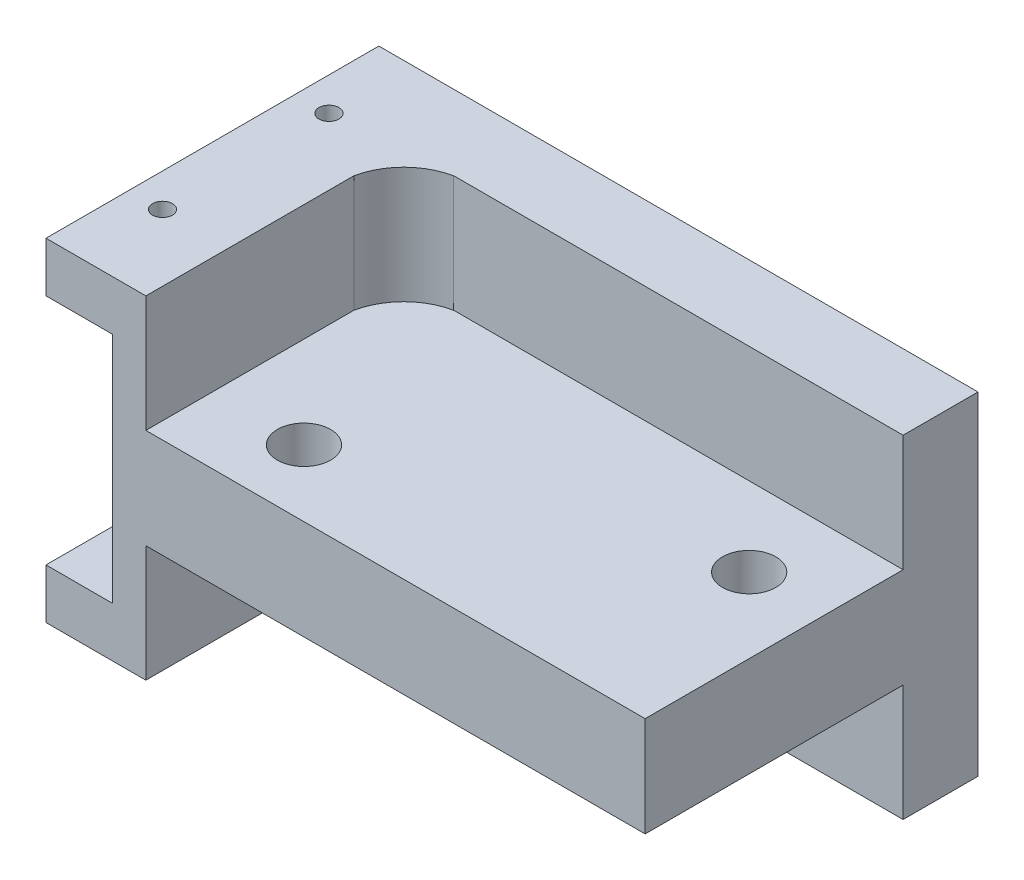
ISO-10303-21;
HEADER;
FILE_DESCRIPTION(('STEP AP214'),'2;1');
FILE_NAME('part.step','',(''),(''),'','','');
FILE_SCHEMA(('AUTOMOTIVE_DESIGN { 1 0 10303 214 1 1 1 1 }'));
ENDSEC;
DATA;
#1=APPLICATION_CONTEXT('core data for automotive mechanical design processes');
#2=APPLICATION_PROTOCOL_DEFINITION('international standard','automotive_design',2000,#1);
#3=PRODUCT_CONTEXT('',#1,'mechanical');
#4=PRODUCT('Part','Part','',(#3));
#5=PRODUCT_RELATED_PRODUCT_CATEGORY('part','',(#4));
#6=PRODUCT_DEFINITION_FORMATION('','',#4);
#7=PRODUCT_DEFINITION_CONTEXT('part definition',#1,'design');
#8=PRODUCT_DEFINITION('design','',#6,#7);
#9=PRODUCT_DEFINITION_SHAPE('','',#8);
#10=(LENGTH_UNIT() NAMED_UNIT(*) SI_UNIT(.MILLI.,.METRE.));
#11=(NAMED_UNIT(*) PLANE_ANGLE_UNIT() SI_UNIT($,.RADIAN.));
#12=(NAMED_UNIT(*) SI_UNIT($,.STERADIAN.) SOLID_ANGLE_UNIT());
#13=UNCERTAINTY_MEASURE_WITH_UNIT(LENGTH_MEASURE(1.E-05),#10,'distance_accuracy_value','');
#14=(GEOMETRIC_REPRESENTATION_CONTEXT(3) GLOBAL_UNCERTAINTY_ASSIGNED_CONTEXT((#13)) GLOBAL_UNIT_ASSIGNED_CONTEXT((#10,
#11,#12)) REPRESENTATION_CONTEXT('',''));
#15=CARTESIAN_POINT('',(0.,0.,0.));
#16=DIRECTION('',(0.,0.,1.));
#17=DIRECTION('',(1.,0.,0.));
#18=AXIS2_PLACEMENT_3D('',#15,#16,#17);
#19=CARTESIAN_POINT('',(17.5,10.,10.));
#20=DIRECTION('',(-1.,0.,0.));
#21=DIRECTION('',(0.,0.,1.));
#22=AXIS2_PLACEMENT_3D('',#19,#20,#21);
#23=PLANE('',#22);
#24=DIRECTION('',(0.,0.,1.));
#25=VECTOR('',#24,1.);
#26=CARTESIAN_POINT('',(17.5,-3.,10.));
#27=LINE('',#26,#25);
#28=CARTESIAN_POINT('',(17.5,-3.,-5.5));
#29=VERTEX_POINT('',#28);
#30=CARTESIAN_POINT('',(17.5,-3.,10.));
#31=VERTEX_POINT('',#30);
#32=EDGE_CURVE('E255',#29,#31,#27,.T.);
#33=ORIENTED_EDGE('',*,*,#32,.F.);
#34=DIRECTION('',(0.,-1.,0.));
#35=VECTOR('',#34,1.);
#36=CARTESIAN_POINT('',(17.5,-3.,-5.5));
#37=LINE('',#36,#35);
#38=CARTESIAN_POINT('',(17.5,-10.,-5.5));
#39=VERTEX_POINT('',#38);
#40=EDGE_CURVE('E263',#29,#39,#37,.T.);
#41=ORIENTED_EDGE('',*,*,#40,.T.);
#42=DIRECTION('',(0.,0.,-1.));
#43=VECTOR('',#42,1.);
#44=CARTESIAN_POINT('',(17.5,-10.,10.));
#45=LINE('',#44,#43);
#46=CARTESIAN_POINT('',(17.5,-10.,-10.));
#47=VERTEX_POINT('',#46);
#48=EDGE_CURVE('E163',#39,#47,#45,.T.);
#49=ORIENTED_EDGE('',*,*,#48,.T.);
#50=DIRECTION('',(0.,-1.,0.));
#51=VECTOR('',#50,1.);
#52=CARTESIAN_POINT('',(17.5,10.,-10.));
#53=LINE('',#52,#51);
#54=CARTESIAN_POINT('',(17.5,10.,-10.));
#55=VERTEX_POINT('',#54);
#56=EDGE_CURVE('E11',#55,#47,#53,.T.);
#57=ORIENTED_EDGE('',*,*,#56,.F.);
#58=DIRECTION('',(0.,0.,-1.));
#59=VECTOR('',#58,1.);
#60=CARTESIAN_POINT('',(17.5,10.,10.));
#61=LINE('',#60,#59);
#62=CARTESIAN_POINT('',(17.5,10.,-5.5));
#63=VERTEX_POINT('',#62);
#64=EDGE_CURVE('E302',#63,#55,#61,.T.);
#65=ORIENTED_EDGE('',*,*,#64,.F.);
#66=DIRECTION('',(0.,1.,0.));
#67=VECTOR('',#66,1.);
#68=CARTESIAN_POINT('',(17.5,3.,-5.5));
#69=LINE('',#68,#67);
#70=CARTESIAN_POINT('',(17.5,3.,-5.5));
#71=VERTEX_POINT('',#70);
#72=EDGE_CURVE('E287',#71,#63,#69,.T.);
#73=ORIENTED_EDGE('',*,*,#72,.F.);
#74=DIRECTION('',(0.,0.,-1.));
#75=VECTOR('',#74,1.);
#76=CARTESIAN_POINT('',(17.5,3.,-5.5));
#77=LINE('',#76,#75);
#78=CARTESIAN_POINT('',(17.5,3.,10.));
#79=VERTEX_POINT('',#78);
#80=EDGE_CURVE('E274',#79,#71,#77,.T.);
#81=ORIENTED_EDGE('',*,*,#80,.F.);
#82=DIRECTION('',(0.,-1.,0.));
#83=VECTOR('',#82,1.);
#84=CARTESIAN_POINT('',(17.5,10.,10.));
#85=LINE('',#84,#83);
#86=EDGE_CURVE('E44',#79,#31,#85,.T.);
#87=ORIENTED_EDGE('',*,*,#86,.T.);
#88=EDGE_LOOP('',(#33,#41,#49,#57,#65,#73,#81,#87));
#89=FACE_BOUND('',#88,.T.);
#90=ADVANCED_FACE('F36',(#89),#23,.F.);
#91=CARTESIAN_POINT('',(-17.5,10.,-10.));
#92=DIRECTION('',(0.,0.,1.));
#93=DIRECTION('',(1.,0.,0.));
#94=AXIS2_PLACEMENT_3D('',#91,#92,#93);
#95=PLANE('',#94);
#96=DIRECTION('',(0.,-1.,0.));
#97=VECTOR('',#96,1.);
#98=CARTESIAN_POINT('',(-14.5,7.,-10.));
#99=LINE('',#98,#97);
#100=CARTESIAN_POINT('',(-14.5,7.,-10.));
#101=VERTEX_POINT('',#100);
#102=CARTESIAN_POINT('',(-14.5,-7.,-10.));
#103=VERTEX_POINT('',#102);
#104=EDGE_CURVE('E211',#101,#103,#99,.T.);
#105=ORIENTED_EDGE('',*,*,#104,.F.);
#106=DIRECTION('',(-1.,0.,0.));
#107=VECTOR('',#106,1.);
#108=CARTESIAN_POINT('',(-14.5,7.,-10.));
#109=LINE('',#108,#107);
#110=CARTESIAN_POINT('',(-18.5,7.,-10.));
#111=VERTEX_POINT('',#110);
#112=EDGE_CURVE('E228',#101,#111,#109,.T.);
#113=ORIENTED_EDGE('',*,*,#112,.T.);
#114=DIRECTION('',(0.,-1.,0.));
#115=VECTOR('',#114,1.);
#116=CARTESIAN_POINT('',(-18.5,10.,-10.));
#117=LINE('',#116,#115);
#118=CARTESIAN_POINT('',(-18.5,10.,-10.));
#119=VERTEX_POINT('',#118);
#120=EDGE_CURVE('E183',#119,#111,#117,.T.);
#121=ORIENTED_EDGE('',*,*,#120,.F.);
#122=DIRECTION('',(-1.,0.,0.));
#123=VECTOR('',#122,1.);
#124=CARTESIAN_POINT('',(-17.5,10.,-10.));
#125=LINE('',#124,#123);
#126=EDGE_CURVE('E304',#55,#119,#125,.T.);
#127=ORIENTED_EDGE('',*,*,#126,.F.);
#128=ORIENTED_EDGE('',*,*,#56,.T.);
#129=DIRECTION('',(-1.,0.,0.));
#130=VECTOR('',#129,1.);
#131=CARTESIAN_POINT('',(-17.5,-10.,-10.));
#132=LINE('',#131,#130);
#133=CARTESIAN_POINT('',(-18.5,-10.,-10.));
#134=VERTEX_POINT('',#133);
#135=EDGE_CURVE('E151',#47,#134,#132,.T.);
#136=ORIENTED_EDGE('',*,*,#135,.T.);
#137=DIRECTION('',(0.,-1.,0.));
#138=VECTOR('',#137,1.);
#139=CARTESIAN_POINT('',(-18.5,-7.,-10.));
#140=LINE('',#139,#138);
#141=CARTESIAN_POINT('',(-18.5,-7.,-10.));
#142=VERTEX_POINT('',#141);
#143=EDGE_CURVE('E157',#142,#134,#140,.T.);
#144=ORIENTED_EDGE('',*,*,#143,.F.);
#145=DIRECTION('',(-1.,0.,0.));
#146=VECTOR('',#145,1.);
#147=CARTESIAN_POINT('',(-14.5,-7.,-10.));
#148=LINE('',#147,#146);
#149=EDGE_CURVE('E227',#103,#142,#148,.T.);
#150=ORIENTED_EDGE('',*,*,#149,.F.);
#151=EDGE_LOOP('',(#105,#113,#121,#127,#128,#136,#144,#150));
#152=FACE_BOUND('',#151,.T.);
#153=ADVANCED_FACE('F154',(#152),#95,.F.);
#154=CARTESIAN_POINT('',(-17.5,10.,10.));
#155=DIRECTION('',(0.,0.,-1.));
#156=DIRECTION('',(-1.,0.,0.));
#157=AXIS2_PLACEMENT_3D('',#154,#155,#156);
#158=PLANE('',#157);
#159=DIRECTION('',(1.,0.,0.));
#160=VECTOR('',#159,1.);
#161=CARTESIAN_POINT('',(-17.5,10.,10.));
#162=LINE('',#161,#160);
#163=CARTESIAN_POINT('',(-18.5,10.,10.));
#164=VERTEX_POINT('',#163);
#165=CARTESIAN_POINT('',(-12.5,10.,10.));
#166=VERTEX_POINT('',#165);
#167=EDGE_CURVE('E306',#164,#166,#162,.T.);
#168=ORIENTED_EDGE('',*,*,#167,.F.);
#169=DIRECTION('',(0.,1.,0.));
#170=VECTOR('',#169,1.);
#171=CARTESIAN_POINT('',(-18.5,10.,10.));
#172=LINE('',#171,#170);
#173=CARTESIAN_POINT('',(-18.5,7.,10.));
#174=VERTEX_POINT('',#173);
#175=EDGE_CURVE('E189',#174,#164,#172,.T.);
#176=ORIENTED_EDGE('',*,*,#175,.F.);
#177=DIRECTION('',(-1.,0.,0.));
#178=VECTOR('',#177,1.);
#179=CARTESIAN_POINT('',(-14.5,7.,10.));
#180=LINE('',#179,#178);
#181=CARTESIAN_POINT('',(-14.5,7.,10.));
#182=VERTEX_POINT('',#181);
#183=EDGE_CURVE('E231',#182,#174,#180,.T.);
#184=ORIENTED_EDGE('',*,*,#183,.F.);
#185=DIRECTION('',(0.,1.,0.));
#186=VECTOR('',#185,1.);
#187=CARTESIAN_POINT('',(-14.5,7.,10.));
#188=LINE('',#187,#186);
#189=CARTESIAN_POINT('',(-14.5,-7.,10.));
#190=VERTEX_POINT('',#189);
#191=EDGE_CURVE('E222',#190,#182,#188,.T.);
#192=ORIENTED_EDGE('',*,*,#191,.F.);
#193=DIRECTION('',(-1.,0.,0.));
#194=VECTOR('',#193,1.);
#195=CARTESIAN_POINT('',(-14.5,-7.,10.));
#196=LINE('',#195,#194);
#197=CARTESIAN_POINT('',(-18.5,-7.,10.));
#198=VERTEX_POINT('',#197);
#199=EDGE_CURVE('E233',#190,#198,#196,.T.);
#200=ORIENTED_EDGE('',*,*,#199,.T.);
#201=DIRECTION('',(0.,1.,0.));
#202=VECTOR('',#201,1.);
#203=CARTESIAN_POINT('',(-18.5,-7.,10.));
#204=LINE('',#203,#202);
#205=CARTESIAN_POINT('',(-18.5,-10.,10.));
#206=VERTEX_POINT('',#205);
#207=EDGE_CURVE('E173',#206,#198,#204,.T.);
#208=ORIENTED_EDGE('',*,*,#207,.F.);
#209=DIRECTION('',(1.,0.,0.));
#210=VECTOR('',#209,1.);
#211=CARTESIAN_POINT('',(-17.5,-10.,10.));
#212=LINE('',#211,#210);
#213=CARTESIAN_POINT('',(-12.5,-10.,10.));
#214=VERTEX_POINT('',#213);
#215=EDGE_CURVE('E162',#206,#214,#212,.T.);
#216=ORIENTED_EDGE('',*,*,#215,.T.);
#217=DIRECTION('',(0.,-1.,0.));
#218=VECTOR('',#217,1.);
#219=CARTESIAN_POINT('',(-12.5,-3.,10.));
#220=LINE('',#219,#218);
#221=CARTESIAN_POINT('',(-12.5,-3.,10.));
#222=VERTEX_POINT('',#221);
#223=EDGE_CURVE('E60',#222,#214,#220,.T.);
#224=ORIENTED_EDGE('',*,*,#223,.F.);
#225=DIRECTION('',(-1.,0.,0.));
#226=VECTOR('',#225,1.);
#227=CARTESIAN_POINT('',(-12.5,-3.,10.));
#228=LINE('',#227,#226);
#229=EDGE_CURVE('E242',#31,#222,#228,.T.);
#230=ORIENTED_EDGE('',*,*,#229,.F.);
#231=ORIENTED_EDGE('',*,*,#86,.F.);
#232=DIRECTION('',(1.,0.,0.));
#233=VECTOR('',#232,1.);
#234=CARTESIAN_POINT('',(17.5,3.,10.));
#235=LINE('',#234,#233);
#236=CARTESIAN_POINT('',(-12.5,3.,10.));
#237=VERTEX_POINT('',#236);
#238=EDGE_CURVE('E272',#237,#79,#235,.T.);
#239=ORIENTED_EDGE('',*,*,#238,.F.);
#240=DIRECTION('',(0.,1.,0.));
#241=VECTOR('',#240,1.);
#242=CARTESIAN_POINT('',(-12.5,3.,10.));
#243=LINE('',#242,#241);
#244=EDGE_CURVE('E294',#237,#166,#243,.T.);
#245=ORIENTED_EDGE('',*,*,#244,.T.);
#246=EDGE_LOOP('',(#168,#176,#184,#192,#200,#208,#216,#224,#230,#231,#239,#245));
#247=FACE_BOUND('',#246,.T.);
#248=ADVANCED_FACE('F332',(#247),#158,.F.);
#249=CARTESIAN_POINT('',(0.,10.,0.));
#250=DIRECTION('',(0.,-1.,0.));
#251=DIRECTION('',(0.,0.,-1.));
#252=AXIS2_PLACEMENT_3D('',#249,#250,#251);
#253=PLANE('',#252);
#254=CARTESIAN_POINT('',(-16.5,10.,-5.));
#255=DIRECTION('',(0.,1.,0.));
#256=DIRECTION('',(0.,0.,1.));
#257=AXIS2_PLACEMENT_3D('',#254,#255,#256);
#258=CIRCLE('',#257,0.6);
#259=CARTESIAN_POINT('',(-16.5,10.,-4.4));
#260=VERTEX_POINT('',#259);
#261=EDGE_CURVE('E212',#260,#260,#258,.T.);
#262=ORIENTED_EDGE('',*,*,#261,.F.);
#263=EDGE_LOOP('',(#262));
#264=FACE_BOUND('',#263,.T.);
#265=CARTESIAN_POINT('',(-16.5,10.,5.));
#266=DIRECTION('',(0.,1.,0.));
#267=DIRECTION('',(0.,0.,1.));
#268=AXIS2_PLACEMENT_3D('',#265,#266,#267);
#269=CIRCLE('',#268,0.6);
#270=CARTESIAN_POINT('',(-16.5,10.,5.6));
#271=VERTEX_POINT('',#270);
#272=EDGE_CURVE('E199',#271,#271,#269,.T.);
#273=ORIENTED_EDGE('',*,*,#272,.F.);
#274=EDGE_LOOP('',(#273));
#275=FACE_BOUND('',#274,.T.);
#276=ORIENTED_EDGE('',*,*,#167,.T.);
#277=DIRECTION('',(0.,0.,1.));
#278=VECTOR('',#277,1.);
#279=CARTESIAN_POINT('',(-12.5,10.,10.));
#280=LINE('',#279,#278);
#281=CARTESIAN_POINT('',(-12.5,10.,-2.5));
#282=VERTEX_POINT('',#281);
#283=EDGE_CURVE('E275',#282,#166,#280,.T.);
#284=ORIENTED_EDGE('',*,*,#283,.F.);
#285=CARTESIAN_POINT('',(-8.70810267121714,10.,-1.70810267121714));
#286=DIRECTION('',(0.,1.,0.));
#287=DIRECTION('',(0.,0.,-1.));
#288=AXIS2_PLACEMENT_3D('',#285,#286,#287);
#289=CIRCLE('',#288,3.87370452298108);
#290=CARTESIAN_POINT('',(-9.5,10.,-5.5));
#291=VERTEX_POINT('',#290);
#292=EDGE_CURVE('E290',#291,#282,#289,.T.);
#293=ORIENTED_EDGE('',*,*,#292,.F.);
#294=DIRECTION('',(-1.,0.,0.));
#295=VECTOR('',#294,1.);
#296=CARTESIAN_POINT('',(-9.5,10.,-5.5));
#297=LINE('',#296,#295);
#298=EDGE_CURVE('E266',#63,#291,#297,.T.);
#299=ORIENTED_EDGE('',*,*,#298,.F.);
#300=ORIENTED_EDGE('',*,*,#64,.T.);
#301=ORIENTED_EDGE('',*,*,#126,.T.);
#302=DIRECTION('',(0.,0.,-1.));
#303=VECTOR('',#302,1.);
#304=CARTESIAN_POINT('',(-18.5,10.,-10.));
#305=LINE('',#304,#303);
#306=EDGE_CURVE('E192',#164,#119,#305,.T.);
#307=ORIENTED_EDGE('',*,*,#306,.F.);
#308=EDGE_LOOP('',(#276,#284,#293,#299,#300,#301,#307));
#309=FACE_BOUND('',#308,.T.);
#310=ADVANCED_FACE('F348',(#264,#275,#309),#253,.F.);
#311=CARTESIAN_POINT('',(0.,-10.,0.));
#312=DIRECTION('',(0.,-1.,0.));
#313=DIRECTION('',(0.,0.,-1.));
#314=AXIS2_PLACEMENT_3D('',#311,#312,#313);
#315=PLANE('',#314);
#316=CARTESIAN_POINT('',(-16.5,-10.,5.));
#317=DIRECTION('',(0.,-1.,0.));
#318=DIRECTION('',(0.,0.,-1.));
#319=AXIS2_PLACEMENT_3D('',#316,#317,#318);
#320=CIRCLE('',#319,0.6);
#321=CARTESIAN_POINT('',(-16.5,-10.,4.4));
#322=VERTEX_POINT('',#321);
#323=EDGE_CURVE('E200',#322,#322,#320,.T.);
#324=ORIENTED_EDGE('',*,*,#323,.F.);
#325=EDGE_LOOP('',(#324));
#326=FACE_BOUND('',#325,.T.);
#327=CARTESIAN_POINT('',(-16.5,-10.,-5.));
#328=DIRECTION('',(0.,-1.,0.));
#329=DIRECTION('',(0.,0.,-1.));
#330=AXIS2_PLACEMENT_3D('',#327,#328,#329);
#331=CIRCLE('',#330,0.6);
#332=CARTESIAN_POINT('',(-16.5,-10.,-5.6));
#333=VERTEX_POINT('',#332);
#334=EDGE_CURVE('E195',#333,#333,#331,.T.);
#335=ORIENTED_EDGE('',*,*,#334,.F.);
#336=EDGE_LOOP('',(#335));
#337=FACE_BOUND('',#336,.T.);
#338=DIRECTION('',(1.,0.,0.));
#339=VECTOR('',#338,1.);
#340=CARTESIAN_POINT('',(-9.5,-10.,-5.5));
#341=LINE('',#340,#339);
#342=CARTESIAN_POINT('',(-9.5,-10.,-5.5));
#343=VERTEX_POINT('',#342);
#344=EDGE_CURVE('E246',#343,#39,#341,.T.);
#345=ORIENTED_EDGE('',*,*,#344,.F.);
#346=CARTESIAN_POINT('',(-9.13466706674538,-10.,-2.13466706674538));
#347=DIRECTION('',(0.,-1.,0.));
#348=DIRECTION('',(0.,0.,-1.));
#349=AXIS2_PLACEMENT_3D('',#346,#347,#348);
#350=CIRCLE('',#349,3.38510471090166);
#351=CARTESIAN_POINT('',(-12.5,-10.,-2.5));
#352=VERTEX_POINT('',#351);
#353=EDGE_CURVE('E259',#352,#343,#350,.T.);
#354=ORIENTED_EDGE('',*,*,#353,.F.);
#355=DIRECTION('',(0.,0.,-1.));
#356=VECTOR('',#355,1.);
#357=CARTESIAN_POINT('',(-12.5,-10.,10.));
#358=LINE('',#357,#356);
#359=EDGE_CURVE('E257',#214,#352,#358,.T.);
#360=ORIENTED_EDGE('',*,*,#359,.F.);
#361=ORIENTED_EDGE('',*,*,#215,.F.);
#362=DIRECTION('',(0.,0.,1.));
#363=VECTOR('',#362,1.);
#364=CARTESIAN_POINT('',(-18.5,-10.,-10.));
#365=LINE('',#364,#363);
#366=EDGE_CURVE('E166',#134,#206,#365,.T.);
#367=ORIENTED_EDGE('',*,*,#366,.F.);
#368=ORIENTED_EDGE('',*,*,#135,.F.);
#369=ORIENTED_EDGE('',*,*,#48,.F.);
#370=EDGE_LOOP('',(#345,#354,#360,#361,#367,#368,#369));
#371=FACE_BOUND('',#370,.T.);
#372=ADVANCED_FACE('F168',(#326,#337,#371),#315,.T.);
#373=CARTESIAN_POINT('',(-12.5,3.,10.));
#374=DIRECTION('',(-1.,0.,0.));
#375=DIRECTION('',(0.,0.,1.));
#376=AXIS2_PLACEMENT_3D('',#373,#374,#375);
#377=PLANE('',#376);
#378=ORIENTED_EDGE('',*,*,#283,.T.);
#379=ORIENTED_EDGE('',*,*,#244,.F.);
#380=DIRECTION('',(0.,0.,1.));
#381=VECTOR('',#380,1.);
#382=CARTESIAN_POINT('',(-12.5,3.,10.));
#383=LINE('',#382,#381);
#384=CARTESIAN_POINT('',(-12.5,3.,-2.5));
#385=VERTEX_POINT('',#384);
#386=EDGE_CURVE('E284',#385,#237,#383,.T.);
#387=ORIENTED_EDGE('',*,*,#386,.F.);
#388=DIRECTION('',(0.,1.,0.));
#389=VECTOR('',#388,1.);
#390=CARTESIAN_POINT('',(-12.5,3.,-2.5));
#391=LINE('',#390,#389);
#392=EDGE_CURVE('E297',#385,#282,#391,.T.);
#393=ORIENTED_EDGE('',*,*,#392,.T.);
#394=EDGE_LOOP('',(#378,#379,#387,#393));
#395=FACE_BOUND('',#394,.T.);
#396=ADVANCED_FACE('F379',(#395),#377,.F.);
#397=CARTESIAN_POINT('',(-8.70810267121714,3.,-1.70810267121714));
#398=DIRECTION('',(0.,1.,0.));
#399=DIRECTION('',(0.,0.,1.));
#400=AXIS2_PLACEMENT_3D('',#397,#398,#399);
#401=CYLINDRICAL_SURFACE('',#400,3.87370452298108);
#402=ORIENTED_EDGE('',*,*,#292,.T.);
#403=ORIENTED_EDGE('',*,*,#392,.F.);
#404=CARTESIAN_POINT('',(-8.70810267121714,3.,-1.70810267121714));
#405=DIRECTION('',(0.,1.,0.));
#406=DIRECTION('',(0.,0.,-1.));
#407=AXIS2_PLACEMENT_3D('',#404,#405,#406);
#408=CIRCLE('',#407,3.87370452298108);
#409=CARTESIAN_POINT('',(-9.5,3.,-5.5));
#410=VERTEX_POINT('',#409);
#411=EDGE_CURVE('E281',#410,#385,#408,.T.);
#412=ORIENTED_EDGE('',*,*,#411,.F.);
#413=DIRECTION('',(0.,1.,0.));
#414=VECTOR('',#413,1.);
#415=CARTESIAN_POINT('',(-9.5,3.,-5.5));
#416=LINE('',#415,#414);
#417=EDGE_CURVE('E299',#410,#291,#416,.T.);
#418=ORIENTED_EDGE('',*,*,#417,.T.);
#419=EDGE_LOOP('',(#402,#403,#412,#418));
#420=FACE_BOUND('',#419,.T.);
#421=ADVANCED_FACE('F388',(#420),#401,.F.);
#422=CARTESIAN_POINT('',(-9.5,3.,-5.5));
#423=DIRECTION('',(0.,0.,-1.));
#424=DIRECTION('',(-1.,0.,0.));
#425=AXIS2_PLACEMENT_3D('',#422,#423,#424);
#426=PLANE('',#425);
#427=ORIENTED_EDGE('',*,*,#298,.T.);
#428=ORIENTED_EDGE('',*,*,#417,.F.);
#429=DIRECTION('',(-1.,0.,0.));
#430=VECTOR('',#429,1.);
#431=CARTESIAN_POINT('',(-9.5,3.,-5.5));
#432=LINE('',#431,#430);
#433=EDGE_CURVE('E278',#71,#410,#432,.T.);
#434=ORIENTED_EDGE('',*,*,#433,.F.);
#435=ORIENTED_EDGE('',*,*,#72,.T.);
#436=EDGE_LOOP('',(#427,#428,#434,#435));
#437=FACE_BOUND('',#436,.T.);
#438=ADVANCED_FACE('F384',(#437),#426,.F.);
#439=CARTESIAN_POINT('',(-8.70810267121714,3.,-1.70810267121714));
#440=DIRECTION('',(0.,-1.,0.));
#441=DIRECTION('',(0.,0.,-1.));
#442=AXIS2_PLACEMENT_3D('',#439,#440,#441);
#443=PLANE('',#442);
#444=CARTESIAN_POINT('',(-7.,3.,6.));
#445=DIRECTION('',(0.,1.,0.));
#446=DIRECTION('',(0.,0.,1.));
#447=AXIS2_PLACEMENT_3D('',#444,#445,#446);
#448=CIRCLE('',#447,1.6);
#449=CARTESIAN_POINT('',(-7.,3.,7.6));
#450=VERTEX_POINT('',#449);
#451=EDGE_CURVE('E236',#450,#450,#448,.T.);
#452=ORIENTED_EDGE('',*,*,#451,.F.);
#453=EDGE_LOOP('',(#452));
#454=FACE_BOUND('',#453,.T.);
#455=CARTESIAN_POINT('',(13.,3.,-0.75));
#456=DIRECTION('',(0.,1.,0.));
#457=DIRECTION('',(0.,0.,1.));
#458=AXIS2_PLACEMENT_3D('',#455,#456,#457);
#459=CIRCLE('',#458,1.6);
#460=CARTESIAN_POINT('',(13.,3.,0.85));
#461=VERTEX_POINT('',#460);
#462=EDGE_CURVE('E230',#461,#461,#459,.T.);
#463=ORIENTED_EDGE('',*,*,#462,.F.);
#464=EDGE_LOOP('',(#463));
#465=FACE_BOUND('',#464,.T.);
#466=ORIENTED_EDGE('',*,*,#238,.T.);
#467=ORIENTED_EDGE('',*,*,#80,.T.);
#468=ORIENTED_EDGE('',*,*,#433,.T.);
#469=ORIENTED_EDGE('',*,*,#411,.T.);
#470=ORIENTED_EDGE('',*,*,#386,.T.);
#471=EDGE_LOOP('',(#466,#467,#468,#469,#470));
#472=FACE_BOUND('',#471,.T.);
#473=ADVANCED_FACE('F387',(#454,#465,#472),#443,.F.);
#474=CARTESIAN_POINT('',(-9.5,-3.,-5.5));
#475=DIRECTION('',(0.,0.,-1.));
#476=DIRECTION('',(-1.,0.,0.));
#477=AXIS2_PLACEMENT_3D('',#474,#475,#476);
#478=PLANE('',#477);
#479=ORIENTED_EDGE('',*,*,#344,.T.);
#480=ORIENTED_EDGE('',*,*,#40,.F.);
#481=DIRECTION('',(1.,0.,0.));
#482=VECTOR('',#481,1.);
#483=CARTESIAN_POINT('',(-9.5,-3.,-5.5));
#484=LINE('',#483,#482);
#485=CARTESIAN_POINT('',(-9.5,-3.,-5.5));
#486=VERTEX_POINT('',#485);
#487=EDGE_CURVE('E252',#486,#29,#484,.T.);
#488=ORIENTED_EDGE('',*,*,#487,.F.);
#489=DIRECTION('',(0.,-1.,0.));
#490=VECTOR('',#489,1.);
#491=CARTESIAN_POINT('',(-9.5,-3.,-5.5));
#492=LINE('',#491,#490);
#493=EDGE_CURVE('E267',#486,#343,#492,.T.);
#494=ORIENTED_EDGE('',*,*,#493,.T.);
#495=EDGE_LOOP('',(#479,#480,#488,#494));
#496=FACE_BOUND('',#495,.T.);
#497=ADVANCED_FACE('F356',(#496),#478,.F.);
#498=CARTESIAN_POINT('',(-9.13466706674538,-3.,-2.13466706674538));
#499=DIRECTION('',(0.,-1.,0.));
#500=DIRECTION('',(0.,0.,-1.));
#501=AXIS2_PLACEMENT_3D('',#498,#499,#500);
#502=CYLINDRICAL_SURFACE('',#501,3.38510471090166);
#503=ORIENTED_EDGE('',*,*,#353,.T.);
#504=ORIENTED_EDGE('',*,*,#493,.F.);
#505=CARTESIAN_POINT('',(-9.13466706674538,-3.,-2.13466706674538));
#506=DIRECTION('',(0.,-1.,0.));
#507=DIRECTION('',(0.,0.,-1.));
#508=AXIS2_PLACEMENT_3D('',#505,#506,#507);
#509=CIRCLE('',#508,3.38510471090166);
#510=CARTESIAN_POINT('',(-12.5,-3.,-2.5));
#511=VERTEX_POINT('',#510);
#512=EDGE_CURVE('E249',#511,#486,#509,.T.);
#513=ORIENTED_EDGE('',*,*,#512,.F.);
#514=DIRECTION('',(0.,-1.,0.));
#515=VECTOR('',#514,1.);
#516=CARTESIAN_POINT('',(-12.5,-3.,-2.5));
#517=LINE('',#516,#515);
#518=EDGE_CURVE('E269',#511,#352,#517,.T.);
#519=ORIENTED_EDGE('',*,*,#518,.T.);
#520=EDGE_LOOP('',(#503,#504,#513,#519));
#521=FACE_BOUND('',#520,.T.);
#522=ADVANCED_FACE('F360',(#521),#502,.F.);
#523=CARTESIAN_POINT('',(-12.5,-3.,10.));
#524=DIRECTION('',(-1.,0.,0.));
#525=DIRECTION('',(0.,0.,1.));
#526=AXIS2_PLACEMENT_3D('',#523,#524,#525);
#527=PLANE('',#526);
#528=ORIENTED_EDGE('',*,*,#359,.T.);
#529=ORIENTED_EDGE('',*,*,#518,.F.);
#530=DIRECTION('',(0.,0.,-1.));
#531=VECTOR('',#530,1.);
#532=CARTESIAN_POINT('',(-12.5,-3.,10.));
#533=LINE('',#532,#531);
#534=EDGE_CURVE('E245',#222,#511,#533,.T.);
#535=ORIENTED_EDGE('',*,*,#534,.F.);
#536=ORIENTED_EDGE('',*,*,#223,.T.);
#537=EDGE_LOOP('',(#528,#529,#535,#536));
#538=FACE_BOUND('',#537,.T.);
#539=ADVANCED_FACE('F325',(#538),#527,.F.);
#540=CARTESIAN_POINT('',(-9.13466706674538,-3.,-2.13466706674538));
#541=DIRECTION('',(0.,-1.,0.));
#542=DIRECTION('',(0.,0.,-1.));
#543=AXIS2_PLACEMENT_3D('',#540,#541,#542);
#544=PLANE('',#543);
#545=CARTESIAN_POINT('',(-7.,-3.,6.));
#546=DIRECTION('',(0.,-1.,0.));
#547=DIRECTION('',(0.,0.,-1.));
#548=AXIS2_PLACEMENT_3D('',#545,#546,#547);
#549=CIRCLE('',#548,1.6);
#550=CARTESIAN_POINT('',(-7.,-3.,4.4));
#551=VERTEX_POINT('',#550);
#552=EDGE_CURVE('E39',#551,#551,#549,.T.);
#553=ORIENTED_EDGE('',*,*,#552,.F.);
#554=EDGE_LOOP('',(#553));
#555=FACE_BOUND('',#554,.T.);
#556=CARTESIAN_POINT('',(13.,-3.,-0.75));
#557=DIRECTION('',(0.,-1.,0.));
#558=DIRECTION('',(0.,0.,-1.));
#559=AXIS2_PLACEMENT_3D('',#556,#557,#558);
#560=CIRCLE('',#559,1.6);
#561=CARTESIAN_POINT('',(13.,-3.,-2.35));
#562=VERTEX_POINT('',#561);
#563=EDGE_CURVE('E239',#562,#562,#560,.T.);
#564=ORIENTED_EDGE('',*,*,#563,.F.);
#565=EDGE_LOOP('',(#564));
#566=FACE_BOUND('',#565,.T.);
#567=ORIENTED_EDGE('',*,*,#229,.T.);
#568=ORIENTED_EDGE('',*,*,#534,.T.);
#569=ORIENTED_EDGE('',*,*,#512,.T.);
#570=ORIENTED_EDGE('',*,*,#487,.T.);
#571=ORIENTED_EDGE('',*,*,#32,.T.);
#572=EDGE_LOOP('',(#567,#568,#569,#570,#571));
#573=FACE_BOUND('',#572,.T.);
#574=ADVANCED_FACE('F321',(#555,#566,#573),#544,.T.);
#575=CARTESIAN_POINT('',(13.,-4.,-0.75));
#576=DIRECTION('',(0.,1.,0.));
#577=DIRECTION('',(0.,0.,1.));
#578=AXIS2_PLACEMENT_3D('',#575,#576,#577);
#579=CYLINDRICAL_SURFACE('',#578,1.6);
#580=ORIENTED_EDGE('',*,*,#563,.T.);
#581=EDGE_LOOP('',(#580));
#582=FACE_BOUND('',#581,.T.);
#583=ORIENTED_EDGE('',*,*,#462,.T.);
#584=EDGE_LOOP('',(#583));
#585=FACE_BOUND('',#584,.T.);
#586=ADVANCED_FACE('F324',(#582,#585),#579,.F.);
#587=CARTESIAN_POINT('',(-7.,-4.,6.));
#588=DIRECTION('',(0.,1.,0.));
#589=DIRECTION('',(0.,0.,1.));
#590=AXIS2_PLACEMENT_3D('',#587,#588,#589);
#591=CYLINDRICAL_SURFACE('',#590,1.6);
#592=ORIENTED_EDGE('',*,*,#552,.T.);
#593=EDGE_LOOP('',(#592));
#594=FACE_BOUND('',#593,.T.);
#595=ORIENTED_EDGE('',*,*,#451,.T.);
#596=EDGE_LOOP('',(#595));
#597=FACE_BOUND('',#596,.T.);
#598=ADVANCED_FACE('F318',(#594,#597),#591,.F.);
#599=CARTESIAN_POINT('',(-14.5,7.,-10.));
#600=DIRECTION('',(0.,1.,0.));
#601=DIRECTION('',(0.,0.,1.));
#602=AXIS2_PLACEMENT_3D('',#599,#600,#601);
#603=PLANE('',#602);
#604=CARTESIAN_POINT('',(-16.5,7.,-5.));
#605=DIRECTION('',(0.,1.,0.));
#606=DIRECTION('',(0.,0.,1.));
#607=AXIS2_PLACEMENT_3D('',#604,#605,#606);
#608=CIRCLE('',#607,0.6);
#609=CARTESIAN_POINT('',(-16.5,7.,-4.4));
#610=VERTEX_POINT('',#609);
#611=EDGE_CURVE('E208',#610,#610,#608,.T.);
#612=ORIENTED_EDGE('',*,*,#611,.T.);
#613=EDGE_LOOP('',(#612));
#614=FACE_BOUND('',#613,.T.);
#615=CARTESIAN_POINT('',(-16.5,7.,5.));
#616=DIRECTION('',(0.,1.,0.));
#617=DIRECTION('',(0.,0.,1.));
#618=AXIS2_PLACEMENT_3D('',#615,#616,#617);
#619=CIRCLE('',#618,0.6);
#620=CARTESIAN_POINT('',(-16.5,7.,5.6));
#621=VERTEX_POINT('',#620);
#622=EDGE_CURVE('E215',#621,#621,#619,.T.);
#623=ORIENTED_EDGE('',*,*,#622,.T.);
#624=EDGE_LOOP('',(#623));
#625=FACE_BOUND('',#624,.T.);
#626=ORIENTED_EDGE('',*,*,#183,.T.);
#627=DIRECTION('',(0.,0.,1.));
#628=VECTOR('',#627,1.);
#629=CARTESIAN_POINT('',(-18.5,7.,-10.));
#630=LINE('',#629,#628);
#631=EDGE_CURVE('E186',#111,#174,#630,.T.);
#632=ORIENTED_EDGE('',*,*,#631,.F.);
#633=ORIENTED_EDGE('',*,*,#112,.F.);
#634=DIRECTION('',(0.,0.,-1.));
#635=VECTOR('',#634,1.);
#636=CARTESIAN_POINT('',(-14.5,7.,-10.));
#637=LINE('',#636,#635);
#638=EDGE_CURVE('E224',#182,#101,#637,.T.);
#639=ORIENTED_EDGE('',*,*,#638,.F.);
#640=EDGE_LOOP('',(#626,#632,#633,#639));
#641=FACE_BOUND('',#640,.T.);
#642=ADVANCED_FACE('F342',(#614,#625,#641),#603,.F.);
#643=CARTESIAN_POINT('',(-14.5,-7.,-10.));
#644=DIRECTION('',(0.,-1.,0.));
#645=DIRECTION('',(0.,0.,-1.));
#646=AXIS2_PLACEMENT_3D('',#643,#644,#645);
#647=PLANE('',#646);
#648=CARTESIAN_POINT('',(-16.5,-7.,5.));
#649=DIRECTION('',(0.,-1.,0.));
#650=DIRECTION('',(0.,0.,-1.));
#651=AXIS2_PLACEMENT_3D('',#648,#649,#650);
#652=CIRCLE('',#651,0.6);
#653=CARTESIAN_POINT('',(-16.5,-7.,4.4));
#654=VERTEX_POINT('',#653);
#655=EDGE_CURVE('E196',#654,#654,#652,.T.);
#656=ORIENTED_EDGE('',*,*,#655,.T.);
#657=EDGE_LOOP('',(#656));
#658=FACE_BOUND('',#657,.T.);
#659=CARTESIAN_POINT('',(-16.5,-7.,-5.));
#660=DIRECTION('',(0.,-1.,0.));
#661=DIRECTION('',(0.,0.,-1.));
#662=AXIS2_PLACEMENT_3D('',#659,#660,#661);
#663=CIRCLE('',#662,0.6);
#664=CARTESIAN_POINT('',(-16.5,-7.,-5.6));
#665=VERTEX_POINT('',#664);
#666=EDGE_CURVE('E203',#665,#665,#663,.T.);
#667=ORIENTED_EDGE('',*,*,#666,.T.);
#668=EDGE_LOOP('',(#667));
#669=FACE_BOUND('',#668,.T.);
#670=ORIENTED_EDGE('',*,*,#149,.T.);
#671=DIRECTION('',(0.,0.,-1.));
#672=VECTOR('',#671,1.);
#673=CARTESIAN_POINT('',(-18.5,-7.,-10.));
#674=LINE('',#673,#672);
#675=EDGE_CURVE('E178',#198,#142,#674,.T.);
#676=ORIENTED_EDGE('',*,*,#675,.F.);
#677=ORIENTED_EDGE('',*,*,#199,.F.);
#678=DIRECTION('',(0.,0.,1.));
#679=VECTOR('',#678,1.);
#680=CARTESIAN_POINT('',(-14.5,-7.,-10.));
#681=LINE('',#680,#679);
#682=EDGE_CURVE('E52',#103,#190,#681,.T.);
#683=ORIENTED_EDGE('',*,*,#682,.F.);
#684=EDGE_LOOP('',(#670,#676,#677,#683));
#685=FACE_BOUND('',#684,.T.);
#686=ADVANCED_FACE('F335',(#658,#669,#685),#647,.F.);
#687=CARTESIAN_POINT('',(-14.5,0.,0.));
#688=DIRECTION('',(-1.,0.,0.));
#689=DIRECTION('',(0.,0.,1.));
#690=AXIS2_PLACEMENT_3D('',#687,#688,#689);
#691=PLANE('',#690);
#692=ORIENTED_EDGE('',*,*,#104,.T.);
#693=ORIENTED_EDGE('',*,*,#682,.T.);
#694=ORIENTED_EDGE('',*,*,#191,.T.);
#695=ORIENTED_EDGE('',*,*,#638,.T.);
#696=EDGE_LOOP('',(#692,#693,#694,#695));
#697=FACE_BOUND('',#696,.T.);
#698=ADVANCED_FACE('F338',(#697),#691,.T.);
#699=CARTESIAN_POINT('',(-16.5,7.,5.));
#700=DIRECTION('',(0.,1.,0.));
#701=DIRECTION('',(0.,0.,1.));
#702=AXIS2_PLACEMENT_3D('',#699,#700,#701);
#703=CYLINDRICAL_SURFACE('',#702,0.6);
#704=ORIENTED_EDGE('',*,*,#622,.F.);
#705=EDGE_LOOP('',(#704));
#706=FACE_BOUND('',#705,.T.);
#707=ORIENTED_EDGE('',*,*,#272,.T.);
#708=EDGE_LOOP('',(#707));
#709=FACE_BOUND('',#708,.T.);
#710=ADVANCED_FACE('F426',(#706,#709),#703,.F.);
#711=CARTESIAN_POINT('',(-16.5,7.,-5.));
#712=DIRECTION('',(0.,1.,0.));
#713=DIRECTION('',(0.,0.,1.));
#714=AXIS2_PLACEMENT_3D('',#711,#712,#713);
#715=CYLINDRICAL_SURFACE('',#714,0.6);
#716=ORIENTED_EDGE('',*,*,#611,.F.);
#717=EDGE_LOOP('',(#716));
#718=FACE_BOUND('',#717,.T.);
#719=ORIENTED_EDGE('',*,*,#261,.T.);
#720=EDGE_LOOP('',(#719));
#721=FACE_BOUND('',#720,.T.);
#722=ADVANCED_FACE('F429',(#718,#721),#715,.F.);
#723=CARTESIAN_POINT('',(-16.5,-7.,-5.));
#724=DIRECTION('',(0.,-1.,0.));
#725=DIRECTION('',(0.,0.,-1.));
#726=AXIS2_PLACEMENT_3D('',#723,#724,#725);
#727=CYLINDRICAL_SURFACE('',#726,0.6);
#728=ORIENTED_EDGE('',*,*,#666,.F.);
#729=EDGE_LOOP('',(#728));
#730=FACE_BOUND('',#729,.T.);
#731=ORIENTED_EDGE('',*,*,#334,.T.);
#732=EDGE_LOOP('',(#731));
#733=FACE_BOUND('',#732,.T.);
#734=ADVANCED_FACE('F433',(#730,#733),#727,.F.);
#735=CARTESIAN_POINT('',(-16.5,-7.,5.));
#736=DIRECTION('',(0.,-1.,0.));
#737=DIRECTION('',(0.,0.,-1.));
#738=AXIS2_PLACEMENT_3D('',#735,#736,#737);
#739=CYLINDRICAL_SURFACE('',#738,0.6);
#740=ORIENTED_EDGE('',*,*,#655,.F.);
#741=EDGE_LOOP('',(#740));
#742=FACE_BOUND('',#741,.T.);
#743=ORIENTED_EDGE('',*,*,#323,.T.);
#744=EDGE_LOOP('',(#743));
#745=FACE_BOUND('',#744,.T.);
#746=ADVANCED_FACE('F437',(#742,#745),#739,.F.);
#747=CARTESIAN_POINT('',(-18.5,0.,0.));
#748=DIRECTION('',(-1.,0.,0.));
#749=DIRECTION('',(0.,0.,1.));
#750=AXIS2_PLACEMENT_3D('',#747,#748,#749);
#751=PLANE('',#750);
#752=ORIENTED_EDGE('',*,*,#120,.T.);
#753=ORIENTED_EDGE('',*,*,#631,.T.);
#754=ORIENTED_EDGE('',*,*,#175,.T.);
#755=ORIENTED_EDGE('',*,*,#306,.T.);
#756=EDGE_LOOP('',(#752,#753,#754,#755));
#757=FACE_BOUND('',#756,.T.);
#758=ADVANCED_FACE('F346',(#757),#751,.T.);
#759=CARTESIAN_POINT('',(-18.5,0.,0.));
#760=DIRECTION('',(-1.,0.,0.));
#761=DIRECTION('',(0.,0.,1.));
#762=AXIS2_PLACEMENT_3D('',#759,#760,#761);
#763=PLANE('',#762);
#764=ORIENTED_EDGE('',*,*,#143,.T.);
#765=ORIENTED_EDGE('',*,*,#366,.T.);
#766=ORIENTED_EDGE('',*,*,#207,.T.);
#767=ORIENTED_EDGE('',*,*,#675,.T.);
#768=EDGE_LOOP('',(#764,#765,#766,#767));
#769=FACE_BOUND('',#768,.T.);
#770=ADVANCED_FACE('F176',(#769),#763,.T.);
#771=CLOSED_SHELL('',(#90,#153,#248,#310,#372,#396,#421,#438,#473,#497,#522,#539,#574,#586,#598,
#642,#686,#698,#710,#722,#734,#746,#758,#770));
#772=MANIFOLD_SOLID_BREP('B2',#771);
#773=ADVANCED_BREP_SHAPE_REPRESENTATION('',(#18,#772),#14);
#774=SHAPE_DEFINITION_REPRESENTATION(#9,#773);
ENDSEC;
END-ISO-10303-21;
